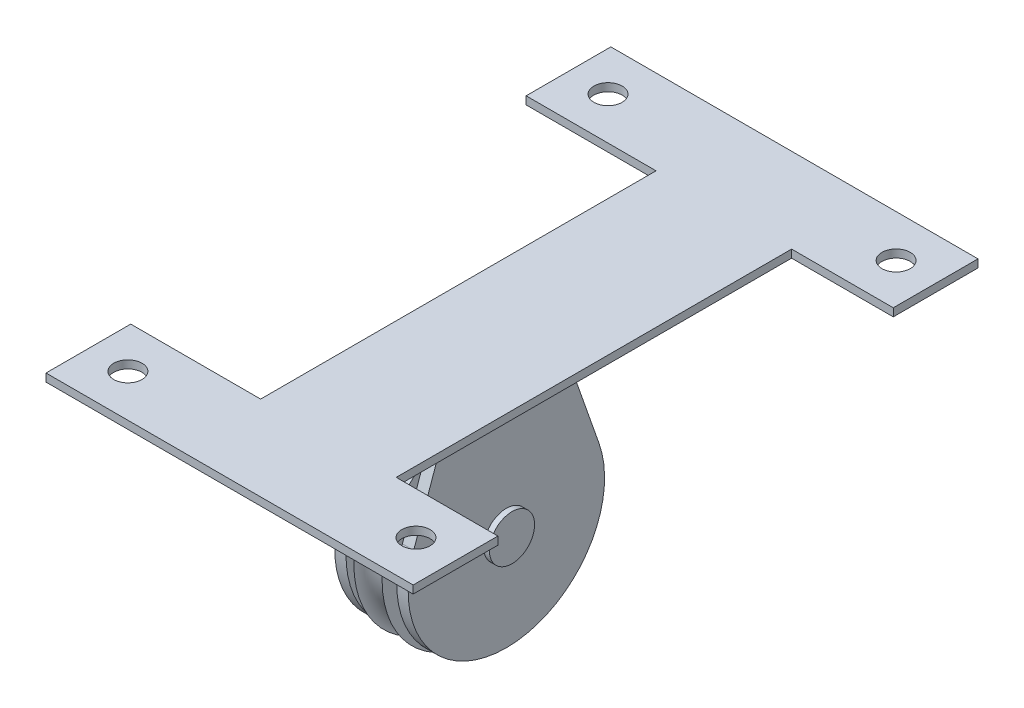
ISO-10303-21;
HEADER;
FILE_DESCRIPTION(('STEP AP214'),'2;1');
FILE_NAME('part.step','',(''),(''),'','','');
FILE_SCHEMA(('AUTOMOTIVE_DESIGN { 1 0 10303 214 1 1 1 1 }'));
ENDSEC;
DATA;
#1=APPLICATION_CONTEXT('core data for automotive mechanical design processes');
#2=APPLICATION_PROTOCOL_DEFINITION('international standard','automotive_design',2000,#1);
#3=PRODUCT_CONTEXT('',#1,'mechanical');
#4=PRODUCT('Part','Part','',(#3));
#5=PRODUCT_RELATED_PRODUCT_CATEGORY('part','',(#4));
#6=PRODUCT_DEFINITION_FORMATION('','',#4);
#7=PRODUCT_DEFINITION_CONTEXT('part definition',#1,'design');
#8=PRODUCT_DEFINITION('design','',#6,#7);
#9=PRODUCT_DEFINITION_SHAPE('','',#8);
#10=(LENGTH_UNIT() NAMED_UNIT(*) SI_UNIT(.MILLI.,.METRE.));
#11=(NAMED_UNIT(*) PLANE_ANGLE_UNIT() SI_UNIT($,.RADIAN.));
#12=(NAMED_UNIT(*) SI_UNIT($,.STERADIAN.) SOLID_ANGLE_UNIT());
#13=UNCERTAINTY_MEASURE_WITH_UNIT(LENGTH_MEASURE(1.E-05),#10,'distance_accuracy_value','');
#14=(GEOMETRIC_REPRESENTATION_CONTEXT(3) GLOBAL_UNCERTAINTY_ASSIGNED_CONTEXT((#13)) GLOBAL_UNIT_ASSIGNED_CONTEXT((#10,
#11,#12)) REPRESENTATION_CONTEXT('',''));
#15=CARTESIAN_POINT('',(0.,0.,0.));
#16=DIRECTION('',(0.,0.,1.));
#17=DIRECTION('',(1.,0.,0.));
#18=AXIS2_PLACEMENT_3D('',#15,#16,#17);
#19=CARTESIAN_POINT('',(0.,28.702,0.));
#20=DIRECTION('',(0.,-1.,0.));
#21=DIRECTION('',(0.,0.,-1.));
#22=AXIS2_PLACEMENT_3D('',#19,#20,#21);
#23=PLANE('',#22);
#24=CARTESIAN_POINT('',(-35.56,28.702,41.275));
#25=DIRECTION('',(0.,-1.,0.));
#26=DIRECTION('',(0.,0.,1.));
#27=AXIS2_PLACEMENT_3D('',#24,#25,#26);
#28=CIRCLE('',#27,3.17499999999999);
#29=CARTESIAN_POINT('',(-35.56,28.702,44.45));
#30=VERTEX_POINT('',#29);
#31=EDGE_CURVE('E712',#30,#30,#28,.T.);
#32=ORIENTED_EDGE('',*,*,#31,.F.);
#33=EDGE_LOOP('',(#32));
#34=FACE_BOUND('',#33,.T.);
#35=CARTESIAN_POINT('',(29.21,28.702,-66.675));
#36=DIRECTION('',(0.,-1.,0.));
#37=DIRECTION('',(0.,0.,1.));
#38=AXIS2_PLACEMENT_3D('',#35,#36,#37);
#39=CIRCLE('',#38,3.17499999999999);
#40=CARTESIAN_POINT('',(29.21,28.702,-63.5));
#41=VERTEX_POINT('',#40);
#42=EDGE_CURVE('E705',#41,#41,#39,.T.);
#43=ORIENTED_EDGE('',*,*,#42,.F.);
#44=EDGE_LOOP('',(#43));
#45=FACE_BOUND('',#44,.T.);
#46=CARTESIAN_POINT('',(-35.56,28.702,-66.675));
#47=DIRECTION('',(0.,-1.,0.));
#48=DIRECTION('',(0.,0.,-1.));
#49=AXIS2_PLACEMENT_3D('',#46,#47,#48);
#50=CIRCLE('',#49,3.17499999999998);
#51=CARTESIAN_POINT('',(-35.56,28.702,-69.85));
#52=VERTEX_POINT('',#51);
#53=EDGE_CURVE('E716',#52,#52,#50,.T.);
#54=ORIENTED_EDGE('',*,*,#53,.F.);
#55=EDGE_LOOP('',(#54));
#56=FACE_BOUND('',#55,.T.);
#57=CARTESIAN_POINT('',(29.21,28.702,41.275));
#58=DIRECTION('',(0.,-1.,0.));
#59=DIRECTION('',(0.,0.,-1.));
#60=AXIS2_PLACEMENT_3D('',#57,#58,#59);
#61=CIRCLE('',#60,3.175);
#62=CARTESIAN_POINT('',(29.21,28.702,38.1));
#63=VERTEX_POINT('',#62);
#64=EDGE_CURVE('E697',#63,#63,#61,.T.);
#65=ORIENTED_EDGE('',*,*,#64,.F.);
#66=EDGE_LOOP('',(#65));
#67=FACE_BOUND('',#66,.T.);
#68=DIRECTION('',(0.,0.,-1.));
#69=VECTOR('',#68,1.);
#70=CARTESIAN_POINT('',(38.1,28.702,50.8));
#71=LINE('',#70,#69);
#72=CARTESIAN_POINT('',(38.1,28.702,50.8));
#73=VERTEX_POINT('',#72);
#74=CARTESIAN_POINT('',(38.1,28.702,31.75));
#75=VERTEX_POINT('',#74);
#76=EDGE_CURVE('E230',#73,#75,#71,.T.);
#77=ORIENTED_EDGE('',*,*,#76,.F.);
#78=DIRECTION('',(1.,0.,0.));
#79=VECTOR('',#78,1.);
#80=CARTESIAN_POINT('',(38.1,28.702,50.8));
#81=LINE('',#80,#79);
#82=CARTESIAN_POINT('',(-44.45,28.702,50.8));
#83=VERTEX_POINT('',#82);
#84=EDGE_CURVE('E264',#83,#73,#81,.T.);
#85=ORIENTED_EDGE('',*,*,#84,.F.);
#86=DIRECTION('',(0.,0.,1.));
#87=VECTOR('',#86,1.);
#88=CARTESIAN_POINT('',(-44.45,28.702,50.8));
#89=LINE('',#88,#87);
#90=CARTESIAN_POINT('',(-44.45,28.702,31.75));
#91=VERTEX_POINT('',#90);
#92=EDGE_CURVE('E261',#91,#83,#89,.T.);
#93=ORIENTED_EDGE('',*,*,#92,.F.);
#94=DIRECTION('',(-1.,0.,0.));
#95=VECTOR('',#94,1.);
#96=CARTESIAN_POINT('',(-44.45,28.702,31.75));
#97=LINE('',#96,#95);
#98=CARTESIAN_POINT('',(-15.2399999999999,28.702,31.75));
#99=VERTEX_POINT('',#98);
#100=EDGE_CURVE('E258',#99,#91,#97,.T.);
#101=ORIENTED_EDGE('',*,*,#100,.F.);
#102=DIRECTION('',(0.,0.,1.));
#103=VECTOR('',#102,1.);
#104=CARTESIAN_POINT('',(-15.2399999999999,28.702,-57.15));
#105=LINE('',#104,#103);
#106=CARTESIAN_POINT('',(-15.2399999999999,28.702,-57.15));
#107=VERTEX_POINT('',#106);
#108=EDGE_CURVE('E255',#107,#99,#105,.T.);
#109=ORIENTED_EDGE('',*,*,#108,.F.);
#110=DIRECTION('',(1.,0.,0.));
#111=VECTOR('',#110,1.);
#112=CARTESIAN_POINT('',(-44.45,28.702,-57.15));
#113=LINE('',#112,#111);
#114=CARTESIAN_POINT('',(-44.45,28.702,-57.15));
#115=VERTEX_POINT('',#114);
#116=EDGE_CURVE('E252',#115,#107,#113,.T.);
#117=ORIENTED_EDGE('',*,*,#116,.F.);
#118=DIRECTION('',(0.,0.,1.));
#119=VECTOR('',#118,1.);
#120=CARTESIAN_POINT('',(-44.45,28.702,-76.2));
#121=LINE('',#120,#119);
#122=CARTESIAN_POINT('',(-44.45,28.702,-76.2));
#123=VERTEX_POINT('',#122);
#124=EDGE_CURVE('E249',#123,#115,#121,.T.);
#125=ORIENTED_EDGE('',*,*,#124,.F.);
#126=DIRECTION('',(-1.,0.,0.));
#127=VECTOR('',#126,1.);
#128=CARTESIAN_POINT('',(38.1,28.702,-76.2));
#129=LINE('',#128,#127);
#130=CARTESIAN_POINT('',(38.1,28.702,-76.2));
#131=VERTEX_POINT('',#130);
#132=EDGE_CURVE('E246',#131,#123,#129,.T.);
#133=ORIENTED_EDGE('',*,*,#132,.F.);
#134=DIRECTION('',(0.,0.,-1.));
#135=VECTOR('',#134,1.);
#136=CARTESIAN_POINT('',(38.1,28.702,-76.2));
#137=LINE('',#136,#135);
#138=CARTESIAN_POINT('',(38.1,28.702,-57.15));
#139=VERTEX_POINT('',#138);
#140=EDGE_CURVE('E243',#139,#131,#137,.T.);
#141=ORIENTED_EDGE('',*,*,#140,.F.);
#142=DIRECTION('',(1.,0.,0.));
#143=VECTOR('',#142,1.);
#144=CARTESIAN_POINT('',(15.24,28.702,-57.15));
#145=LINE('',#144,#143);
#146=CARTESIAN_POINT('',(15.24,28.702,-57.15));
#147=VERTEX_POINT('',#146);
#148=EDGE_CURVE('E240',#147,#139,#145,.T.);
#149=ORIENTED_EDGE('',*,*,#148,.F.);
#150=DIRECTION('',(0.,0.,-1.));
#151=VECTOR('',#150,1.);
#152=CARTESIAN_POINT('',(15.24,28.702,-57.15));
#153=LINE('',#152,#151);
#154=CARTESIAN_POINT('',(15.24,28.702,31.75));
#155=VERTEX_POINT('',#154);
#156=EDGE_CURVE('E237',#155,#147,#153,.T.);
#157=ORIENTED_EDGE('',*,*,#156,.F.);
#158=DIRECTION('',(-1.,0.,0.));
#159=VECTOR('',#158,1.);
#160=CARTESIAN_POINT('',(15.24,28.702,31.75));
#161=LINE('',#160,#159);
#162=EDGE_CURVE('E233',#75,#155,#161,.T.);
#163=ORIENTED_EDGE('',*,*,#162,.F.);
#164=EDGE_LOOP('',(#77,#85,#93,#101,#109,#117,#125,#133,#141,#149,#157,#163));
#165=FACE_BOUND('',#164,.T.);
#166=DIRECTION('',(1.,0.,0.));
#167=VECTOR('',#166,1.);
#168=CARTESIAN_POINT('',(8.255,28.702,-13.3246545720556));
#169=LINE('',#168,#167);
#170=CARTESIAN_POINT('',(5.715,28.702,-13.3246545720556));
#171=VERTEX_POINT('',#170);
#172=CARTESIAN_POINT('',(8.255,28.702,-13.3246545720556));
#173=VERTEX_POINT('',#172);
#174=EDGE_CURVE('E328',#171,#173,#169,.T.);
#175=ORIENTED_EDGE('',*,*,#174,.F.);
#176=DIRECTION('',(0.,0.,-1.));
#177=VECTOR('',#176,1.);
#178=CARTESIAN_POINT('',(5.715,28.702,0.));
#179=LINE('',#178,#177);
#180=CARTESIAN_POINT('',(5.715,28.702,13.3246545720556));
#181=VERTEX_POINT('',#180);
#182=EDGE_CURVE('E70',#181,#171,#179,.T.);
#183=ORIENTED_EDGE('',*,*,#182,.F.);
#184=DIRECTION('',(-1.,0.,0.));
#185=VECTOR('',#184,1.);
#186=CARTESIAN_POINT('',(8.255,28.702,13.3246545720556));
#187=LINE('',#186,#185);
#188=CARTESIAN_POINT('',(8.255,28.702,13.3246545720556));
#189=VERTEX_POINT('',#188);
#190=EDGE_CURVE('E12',#189,#181,#187,.T.);
#191=ORIENTED_EDGE('',*,*,#190,.F.);
#192=DIRECTION('',(0.,0.,-1.));
#193=VECTOR('',#192,1.);
#194=CARTESIAN_POINT('',(8.255,28.702,0.));
#195=LINE('',#194,#193);
#196=EDGE_CURVE('E326',#189,#173,#195,.T.);
#197=ORIENTED_EDGE('',*,*,#196,.T.);
#198=EDGE_LOOP('',(#175,#183,#191,#197));
#199=FACE_BOUND('',#198,.T.);
#200=DIRECTION('',(0.,0.,-1.));
#201=VECTOR('',#200,1.);
#202=CARTESIAN_POINT('',(-5.715,28.702,0.));
#203=LINE('',#202,#201);
#204=CARTESIAN_POINT('',(-5.715,28.702,13.3246545720556));
#205=VERTEX_POINT('',#204);
#206=CARTESIAN_POINT('',(-5.715,28.702,-13.3246545720556));
#207=VERTEX_POINT('',#206);
#208=EDGE_CURVE('E225',#205,#207,#203,.T.);
#209=ORIENTED_EDGE('',*,*,#208,.T.);
#210=DIRECTION('',(-1.,0.,0.));
#211=VECTOR('',#210,1.);
#212=CARTESIAN_POINT('',(0.,28.702,-13.3246545720556));
#213=LINE('',#212,#211);
#214=CARTESIAN_POINT('',(-8.255,28.702,-13.3246545720556));
#215=VERTEX_POINT('',#214);
#216=EDGE_CURVE('E223',#207,#215,#213,.T.);
#217=ORIENTED_EDGE('',*,*,#216,.T.);
#218=DIRECTION('',(0.,0.,-1.));
#219=VECTOR('',#218,1.);
#220=CARTESIAN_POINT('',(-8.255,28.702,0.));
#221=LINE('',#220,#219);
#222=CARTESIAN_POINT('',(-8.255,28.702,13.3246545720556));
#223=VERTEX_POINT('',#222);
#224=EDGE_CURVE('E204',#223,#215,#221,.T.);
#225=ORIENTED_EDGE('',*,*,#224,.F.);
#226=DIRECTION('',(1.,0.,0.));
#227=VECTOR('',#226,1.);
#228=CARTESIAN_POINT('',(0.,28.702,13.3246545720556));
#229=LINE('',#228,#227);
#230=EDGE_CURVE('E194',#223,#205,#229,.T.);
#231=ORIENTED_EDGE('',*,*,#230,.T.);
#232=EDGE_LOOP('',(#209,#217,#225,#231));
#233=FACE_BOUND('',#232,.T.);
#234=ADVANCED_FACE('F47',(#34,#45,#56,#67,#165,#199,#233),#23,.T.);
#235=CARTESIAN_POINT('',(8.255,0.,0.));
#236=DIRECTION('',(1.,0.,0.));
#237=DIRECTION('',(0.,0.,-1.));
#238=AXIS2_PLACEMENT_3D('',#235,#236,#237);
#239=PLANE('',#238);
#240=ORIENTED_EDGE('',*,*,#196,.F.);
#241=DIRECTION('',(0.,-0.943468126786136,0.331463261521786));
#242=VECTOR('',#241,1.);
#243=CARTESIAN_POINT('',(8.255,7.32038118622341,20.8365364336848));
#244=LINE('',#243,#242);
#245=CARTESIAN_POINT('',(8.255,7.32038118622341,20.8365364336848));
#246=VERTEX_POINT('',#245);
#247=EDGE_CURVE('E345',#189,#246,#244,.T.);
#248=ORIENTED_EDGE('',*,*,#247,.T.);
#249=CARTESIAN_POINT('',(8.255,0.,0.));
#250=DIRECTION('',(1.,0.,0.));
#251=DIRECTION('',(0.,0.,-1.));
#252=AXIS2_PLACEMENT_3D('',#249,#250,#251);
#253=CIRCLE('',#252,22.085045421368);
#254=CARTESIAN_POINT('',(8.255,7.32038118622341,-20.8365364336848));
#255=VERTEX_POINT('',#254);
#256=EDGE_CURVE('E338',#246,#255,#253,.T.);
#257=ORIENTED_EDGE('',*,*,#256,.T.);
#258=DIRECTION('',(0.,0.943468126786136,0.331463261521786));
#259=VECTOR('',#258,1.);
#260=CARTESIAN_POINT('',(8.255,7.32038118622341,-20.8365364336848));
#261=LINE('',#260,#259);
#262=EDGE_CURVE('E341',#255,#173,#261,.T.);
#263=ORIENTED_EDGE('',*,*,#262,.T.);
#264=EDGE_LOOP('',(#240,#248,#257,#263));
#265=FACE_BOUND('',#264,.T.);
#266=CARTESIAN_POINT('',(8.255,0.,0.));
#267=DIRECTION('',(1.,0.,0.));
#268=DIRECTION('',(0.,0.,-1.));
#269=AXIS2_PLACEMENT_3D('',#266,#267,#268);
#270=CIRCLE('',#269,5.08);
#271=CARTESIAN_POINT('',(8.255,0.,-5.08));
#272=VERTEX_POINT('',#271);
#273=EDGE_CURVE('E332',#272,#272,#270,.T.);
#274=ORIENTED_EDGE('',*,*,#273,.F.);
#275=EDGE_LOOP('',(#274));
#276=FACE_BOUND('',#275,.T.);
#277=ADVANCED_FACE('F373',(#265,#276),#239,.T.);
#278=CARTESIAN_POINT('',(5.715,0.,0.));
#279=DIRECTION('',(1.,0.,0.));
#280=DIRECTION('',(0.,0.,-1.));
#281=AXIS2_PLACEMENT_3D('',#278,#279,#280);
#282=PLANE('',#281);
#283=DIRECTION('',(0.,-0.943468126786136,0.331463261521786));
#284=VECTOR('',#283,1.);
#285=CARTESIAN_POINT('',(5.715,7.32038118622341,20.8365364336848));
#286=LINE('',#285,#284);
#287=CARTESIAN_POINT('',(5.715,7.32038118622341,20.8365364336848));
#288=VERTEX_POINT('',#287);
#289=EDGE_CURVE('E342',#181,#288,#286,.T.);
#290=ORIENTED_EDGE('',*,*,#289,.F.);
#291=ORIENTED_EDGE('',*,*,#182,.T.);
#292=DIRECTION('',(0.,0.943468126786136,0.331463261521786));
#293=VECTOR('',#292,1.);
#294=CARTESIAN_POINT('',(5.715,7.32038118622341,-20.8365364336848));
#295=LINE('',#294,#293);
#296=CARTESIAN_POINT('',(5.715,7.32038118622341,-20.8365364336848));
#297=VERTEX_POINT('',#296);
#298=EDGE_CURVE('E350',#297,#171,#295,.T.);
#299=ORIENTED_EDGE('',*,*,#298,.F.);
#300=CARTESIAN_POINT('',(5.715,0.,0.));
#301=DIRECTION('',(1.,0.,0.));
#302=DIRECTION('',(0.,0.,-1.));
#303=AXIS2_PLACEMENT_3D('',#300,#301,#302);
#304=CIRCLE('',#303,22.085045421368);
#305=EDGE_CURVE('E335',#288,#297,#304,.T.);
#306=ORIENTED_EDGE('',*,*,#305,.F.);
#307=EDGE_LOOP('',(#290,#291,#299,#306));
#308=FACE_BOUND('',#307,.T.);
#309=CARTESIAN_POINT('',(5.715,0.,0.));
#310=DIRECTION('',(1.,0.,0.));
#311=DIRECTION('',(0.,0.,-1.));
#312=AXIS2_PLACEMENT_3D('',#309,#310,#311);
#313=CIRCLE('',#312,5.08);
#314=CARTESIAN_POINT('',(5.715,0.,-5.08));
#315=VERTEX_POINT('',#314);
#316=EDGE_CURVE('E331',#315,#315,#313,.T.);
#317=ORIENTED_EDGE('',*,*,#316,.T.);
#318=EDGE_LOOP('',(#317));
#319=FACE_BOUND('',#318,.T.);
#320=ADVANCED_FACE('F365',(#308,#319),#282,.F.);
#321=CARTESIAN_POINT('',(8.255,0.,0.));
#322=DIRECTION('',(-1.,0.,0.));
#323=DIRECTION('',(0.,0.,1.));
#324=AXIS2_PLACEMENT_3D('',#321,#322,#323);
#325=CYLINDRICAL_SURFACE('',#324,22.085045421368);
#326=ORIENTED_EDGE('',*,*,#305,.T.);
#327=DIRECTION('',(-1.,0.,0.));
#328=VECTOR('',#327,1.);
#329=CARTESIAN_POINT('',(8.255,7.32038118622341,-20.8365364336848));
#330=LINE('',#329,#328);
#331=EDGE_CURVE('E55',#255,#297,#330,.T.);
#332=ORIENTED_EDGE('',*,*,#331,.F.);
#333=ORIENTED_EDGE('',*,*,#256,.F.);
#334=DIRECTION('',(-1.,0.,0.));
#335=VECTOR('',#334,1.);
#336=CARTESIAN_POINT('',(8.255,7.32038118622341,20.8365364336848));
#337=LINE('',#336,#335);
#338=EDGE_CURVE('E347',#246,#288,#337,.T.);
#339=ORIENTED_EDGE('',*,*,#338,.T.);
#340=EDGE_LOOP('',(#326,#332,#333,#339));
#341=FACE_BOUND('',#340,.T.);
#342=ADVANCED_FACE('F49',(#341),#325,.T.);
#343=CARTESIAN_POINT('',(8.255,7.32038118622341,-20.8365364336848));
#344=DIRECTION('',(0.,-0.331463261521786,0.943468126786136));
#345=DIRECTION('',(0.,-0.943468126786136,-0.331463261521786));
#346=AXIS2_PLACEMENT_3D('',#343,#344,#345);
#347=PLANE('',#346);
#348=ORIENTED_EDGE('',*,*,#298,.T.);
#349=ORIENTED_EDGE('',*,*,#174,.T.);
#350=ORIENTED_EDGE('',*,*,#262,.F.);
#351=ORIENTED_EDGE('',*,*,#331,.T.);
#352=EDGE_LOOP('',(#348,#349,#350,#351));
#353=FACE_BOUND('',#352,.T.);
#354=ADVANCED_FACE('F358',(#353),#347,.F.);
#355=CARTESIAN_POINT('',(8.255,7.32038118622341,20.8365364336848));
#356=DIRECTION('',(0.,-0.331463261521786,-0.943468126786136));
#357=DIRECTION('',(0.,0.943468126786136,-0.331463261521786));
#358=AXIS2_PLACEMENT_3D('',#355,#356,#357);
#359=PLANE('',#358);
#360=ORIENTED_EDGE('',*,*,#247,.F.);
#361=ORIENTED_EDGE('',*,*,#190,.T.);
#362=ORIENTED_EDGE('',*,*,#289,.T.);
#363=ORIENTED_EDGE('',*,*,#338,.F.);
#364=EDGE_LOOP('',(#360,#361,#362,#363));
#365=FACE_BOUND('',#364,.T.);
#366=ADVANCED_FACE('F369',(#365),#359,.F.);
#367=CARTESIAN_POINT('',(8.255,0.,0.));
#368=DIRECTION('',(-1.,0.,0.));
#369=DIRECTION('',(0.,0.,1.));
#370=AXIS2_PLACEMENT_3D('',#367,#368,#369);
#371=CYLINDRICAL_SURFACE('',#370,5.08);
#372=ORIENTED_EDGE('',*,*,#273,.T.);
#373=EDGE_LOOP('',(#372));
#374=FACE_BOUND('',#373,.T.);
#375=ORIENTED_EDGE('',*,*,#316,.F.);
#376=EDGE_LOOP('',(#375));
#377=FACE_BOUND('',#376,.T.);
#378=ADVANCED_FACE('F379',(#374,#377),#371,.F.);
#379=CARTESIAN_POINT('',(38.1,28.702,50.8));
#380=DIRECTION('',(1.,0.,0.));
#381=DIRECTION('',(0.,0.,-1.));
#382=AXIS2_PLACEMENT_3D('',#379,#380,#381);
#383=PLANE('',#382);
#384=DIRECTION('',(0.,0.,-1.));
#385=VECTOR('',#384,1.);
#386=CARTESIAN_POINT('',(38.1,30.48,50.8));
#387=LINE('',#386,#385);
#388=CARTESIAN_POINT('',(38.1,30.48,50.8));
#389=VERTEX_POINT('',#388);
#390=CARTESIAN_POINT('',(38.1,30.48,31.75));
#391=VERTEX_POINT('',#390);
#392=EDGE_CURVE('E229',#389,#391,#387,.T.);
#393=ORIENTED_EDGE('',*,*,#392,.F.);
#394=DIRECTION('',(0.,1.,0.));
#395=VECTOR('',#394,1.);
#396=CARTESIAN_POINT('',(38.1,28.702,50.8));
#397=LINE('',#396,#395);
#398=EDGE_CURVE('E302',#73,#389,#397,.T.);
#399=ORIENTED_EDGE('',*,*,#398,.F.);
#400=ORIENTED_EDGE('',*,*,#76,.T.);
#401=DIRECTION('',(0.,1.,0.));
#402=VECTOR('',#401,1.);
#403=CARTESIAN_POINT('',(38.1,28.702,31.75));
#404=LINE('',#403,#402);
#405=EDGE_CURVE('E267',#75,#391,#404,.T.);
#406=ORIENTED_EDGE('',*,*,#405,.T.);
#407=EDGE_LOOP('',(#393,#399,#400,#406));
#408=FACE_BOUND('',#407,.T.);
#409=ADVANCED_FACE('F382',(#408),#383,.T.);
#410=CARTESIAN_POINT('',(38.1,28.702,50.8));
#411=DIRECTION('',(0.,0.,1.));
#412=DIRECTION('',(1.,0.,0.));
#413=AXIS2_PLACEMENT_3D('',#410,#411,#412);
#414=PLANE('',#413);
#415=DIRECTION('',(1.,0.,0.));
#416=VECTOR('',#415,1.);
#417=CARTESIAN_POINT('',(38.1,30.48,50.8));
#418=LINE('',#417,#416);
#419=CARTESIAN_POINT('',(-44.45,30.48,50.8));
#420=VERTEX_POINT('',#419);
#421=EDGE_CURVE('E234',#420,#389,#418,.T.);
#422=ORIENTED_EDGE('',*,*,#421,.F.);
#423=DIRECTION('',(0.,1.,0.));
#424=VECTOR('',#423,1.);
#425=CARTESIAN_POINT('',(-44.45,28.702,50.8));
#426=LINE('',#425,#424);
#427=EDGE_CURVE('E304',#83,#420,#426,.T.);
#428=ORIENTED_EDGE('',*,*,#427,.F.);
#429=ORIENTED_EDGE('',*,*,#84,.T.);
#430=ORIENTED_EDGE('',*,*,#398,.T.);
#431=EDGE_LOOP('',(#422,#428,#429,#430));
#432=FACE_BOUND('',#431,.T.);
#433=ADVANCED_FACE('F401',(#432),#414,.T.);
#434=CARTESIAN_POINT('',(-44.45,28.702,50.8));
#435=DIRECTION('',(-1.,0.,0.));
#436=DIRECTION('',(0.,0.,1.));
#437=AXIS2_PLACEMENT_3D('',#434,#435,#436);
#438=PLANE('',#437);
#439=DIRECTION('',(0.,0.,1.));
#440=VECTOR('',#439,1.);
#441=CARTESIAN_POINT('',(-44.45,30.48,50.8));
#442=LINE('',#441,#440);
#443=CARTESIAN_POINT('',(-44.45,30.48,31.75));
#444=VERTEX_POINT('',#443);
#445=EDGE_CURVE('E297',#444,#420,#442,.T.);
#446=ORIENTED_EDGE('',*,*,#445,.F.);
#447=DIRECTION('',(0.,1.,0.));
#448=VECTOR('',#447,1.);
#449=CARTESIAN_POINT('',(-44.45,28.702,31.75));
#450=LINE('',#449,#448);
#451=EDGE_CURVE('E306',#91,#444,#450,.T.);
#452=ORIENTED_EDGE('',*,*,#451,.F.);
#453=ORIENTED_EDGE('',*,*,#92,.T.);
#454=ORIENTED_EDGE('',*,*,#427,.T.);
#455=EDGE_LOOP('',(#446,#452,#453,#454));
#456=FACE_BOUND('',#455,.T.);
#457=ADVANCED_FACE('F404',(#456),#438,.T.);
#458=CARTESIAN_POINT('',(-44.45,28.702,31.75));
#459=DIRECTION('',(0.,0.,-1.));
#460=DIRECTION('',(-1.,0.,0.));
#461=AXIS2_PLACEMENT_3D('',#458,#459,#460);
#462=PLANE('',#461);
#463=DIRECTION('',(-1.,0.,0.));
#464=VECTOR('',#463,1.);
#465=CARTESIAN_POINT('',(-44.45,30.48,31.75));
#466=LINE('',#465,#464);
#467=CARTESIAN_POINT('',(-15.2399999999999,30.48,31.75));
#468=VERTEX_POINT('',#467);
#469=EDGE_CURVE('E294',#468,#444,#466,.T.);
#470=ORIENTED_EDGE('',*,*,#469,.F.);
#471=DIRECTION('',(0.,1.,0.));
#472=VECTOR('',#471,1.);
#473=CARTESIAN_POINT('',(-15.2399999999999,28.702,31.75));
#474=LINE('',#473,#472);
#475=EDGE_CURVE('E308',#99,#468,#474,.T.);
#476=ORIENTED_EDGE('',*,*,#475,.F.);
#477=ORIENTED_EDGE('',*,*,#100,.T.);
#478=ORIENTED_EDGE('',*,*,#451,.T.);
#479=EDGE_LOOP('',(#470,#476,#477,#478));
#480=FACE_BOUND('',#479,.T.);
#481=ADVANCED_FACE('F408',(#480),#462,.T.);
#482=CARTESIAN_POINT('',(-15.2399999999999,28.702,-57.15));
#483=DIRECTION('',(-1.,0.,0.));
#484=DIRECTION('',(0.,0.,1.));
#485=AXIS2_PLACEMENT_3D('',#482,#483,#484);
#486=PLANE('',#485);
#487=DIRECTION('',(0.,0.,1.));
#488=VECTOR('',#487,1.);
#489=CARTESIAN_POINT('',(-15.2399999999999,30.48,-57.15));
#490=LINE('',#489,#488);
#491=CARTESIAN_POINT('',(-15.2399999999999,30.48,-57.15));
#492=VERTEX_POINT('',#491);
#493=EDGE_CURVE('E291',#492,#468,#490,.T.);
#494=ORIENTED_EDGE('',*,*,#493,.F.);
#495=DIRECTION('',(0.,1.,0.));
#496=VECTOR('',#495,1.);
#497=CARTESIAN_POINT('',(-15.2399999999999,28.702,-57.15));
#498=LINE('',#497,#496);
#499=EDGE_CURVE('E310',#107,#492,#498,.T.);
#500=ORIENTED_EDGE('',*,*,#499,.F.);
#501=ORIENTED_EDGE('',*,*,#108,.T.);
#502=ORIENTED_EDGE('',*,*,#475,.T.);
#503=EDGE_LOOP('',(#494,#500,#501,#502));
#504=FACE_BOUND('',#503,.T.);
#505=ADVANCED_FACE('F412',(#504),#486,.T.);
#506=CARTESIAN_POINT('',(-44.45,28.702,-57.15));
#507=DIRECTION('',(0.,0.,1.));
#508=DIRECTION('',(1.,0.,0.));
#509=AXIS2_PLACEMENT_3D('',#506,#507,#508);
#510=PLANE('',#509);
#511=DIRECTION('',(1.,0.,0.));
#512=VECTOR('',#511,1.);
#513=CARTESIAN_POINT('',(-44.45,30.48,-57.15));
#514=LINE('',#513,#512);
#515=CARTESIAN_POINT('',(-44.45,30.48,-57.15));
#516=VERTEX_POINT('',#515);
#517=EDGE_CURVE('E288',#516,#492,#514,.T.);
#518=ORIENTED_EDGE('',*,*,#517,.F.);
#519=DIRECTION('',(0.,1.,0.));
#520=VECTOR('',#519,1.);
#521=CARTESIAN_POINT('',(-44.45,28.702,-57.15));
#522=LINE('',#521,#520);
#523=EDGE_CURVE('E312',#115,#516,#522,.T.);
#524=ORIENTED_EDGE('',*,*,#523,.F.);
#525=ORIENTED_EDGE('',*,*,#116,.T.);
#526=ORIENTED_EDGE('',*,*,#499,.T.);
#527=EDGE_LOOP('',(#518,#524,#525,#526));
#528=FACE_BOUND('',#527,.T.);
#529=ADVANCED_FACE('F416',(#528),#510,.T.);
#530=CARTESIAN_POINT('',(-44.45,28.702,-76.2));
#531=DIRECTION('',(-1.,0.,0.));
#532=DIRECTION('',(0.,0.,1.));
#533=AXIS2_PLACEMENT_3D('',#530,#531,#532);
#534=PLANE('',#533);
#535=DIRECTION('',(0.,0.,1.));
#536=VECTOR('',#535,1.);
#537=CARTESIAN_POINT('',(-44.45,30.48,-76.2));
#538=LINE('',#537,#536);
#539=CARTESIAN_POINT('',(-44.45,30.48,-76.2));
#540=VERTEX_POINT('',#539);
#541=EDGE_CURVE('E285',#540,#516,#538,.T.);
#542=ORIENTED_EDGE('',*,*,#541,.F.);
#543=DIRECTION('',(0.,1.,0.));
#544=VECTOR('',#543,1.);
#545=CARTESIAN_POINT('',(-44.45,28.702,-76.2));
#546=LINE('',#545,#544);
#547=EDGE_CURVE('E314',#123,#540,#546,.T.);
#548=ORIENTED_EDGE('',*,*,#547,.F.);
#549=ORIENTED_EDGE('',*,*,#124,.T.);
#550=ORIENTED_EDGE('',*,*,#523,.T.);
#551=EDGE_LOOP('',(#542,#548,#549,#550));
#552=FACE_BOUND('',#551,.T.);
#553=ADVANCED_FACE('F420',(#552),#534,.T.);
#554=CARTESIAN_POINT('',(38.1,28.702,-76.2));
#555=DIRECTION('',(0.,0.,-1.));
#556=DIRECTION('',(-1.,0.,0.));
#557=AXIS2_PLACEMENT_3D('',#554,#555,#556);
#558=PLANE('',#557);
#559=DIRECTION('',(-1.,0.,0.));
#560=VECTOR('',#559,1.);
#561=CARTESIAN_POINT('',(38.1,30.48,-76.2));
#562=LINE('',#561,#560);
#563=CARTESIAN_POINT('',(38.1,30.48,-76.2));
#564=VERTEX_POINT('',#563);
#565=EDGE_CURVE('E282',#564,#540,#562,.T.);
#566=ORIENTED_EDGE('',*,*,#565,.F.);
#567=DIRECTION('',(0.,1.,0.));
#568=VECTOR('',#567,1.);
#569=CARTESIAN_POINT('',(38.1,28.702,-76.2));
#570=LINE('',#569,#568);
#571=EDGE_CURVE('E316',#131,#564,#570,.T.);
#572=ORIENTED_EDGE('',*,*,#571,.F.);
#573=ORIENTED_EDGE('',*,*,#132,.T.);
#574=ORIENTED_EDGE('',*,*,#547,.T.);
#575=EDGE_LOOP('',(#566,#572,#573,#574));
#576=FACE_BOUND('',#575,.T.);
#577=ADVANCED_FACE('F424',(#576),#558,.T.);
#578=CARTESIAN_POINT('',(38.1,28.702,-76.2));
#579=DIRECTION('',(1.,0.,0.));
#580=DIRECTION('',(0.,0.,-1.));
#581=AXIS2_PLACEMENT_3D('',#578,#579,#580);
#582=PLANE('',#581);
#583=DIRECTION('',(0.,0.,-1.));
#584=VECTOR('',#583,1.);
#585=CARTESIAN_POINT('',(38.1,30.48,-76.2));
#586=LINE('',#585,#584);
#587=CARTESIAN_POINT('',(38.1,30.48,-57.15));
#588=VERTEX_POINT('',#587);
#589=EDGE_CURVE('E279',#588,#564,#586,.T.);
#590=ORIENTED_EDGE('',*,*,#589,.F.);
#591=DIRECTION('',(0.,1.,0.));
#592=VECTOR('',#591,1.);
#593=CARTESIAN_POINT('',(38.1,28.702,-57.15));
#594=LINE('',#593,#592);
#595=EDGE_CURVE('E318',#139,#588,#594,.T.);
#596=ORIENTED_EDGE('',*,*,#595,.F.);
#597=ORIENTED_EDGE('',*,*,#140,.T.);
#598=ORIENTED_EDGE('',*,*,#571,.T.);
#599=EDGE_LOOP('',(#590,#596,#597,#598));
#600=FACE_BOUND('',#599,.T.);
#601=ADVANCED_FACE('F428',(#600),#582,.T.);
#602=CARTESIAN_POINT('',(15.24,28.702,-57.15));
#603=DIRECTION('',(0.,0.,1.));
#604=DIRECTION('',(1.,0.,0.));
#605=AXIS2_PLACEMENT_3D('',#602,#603,#604);
#606=PLANE('',#605);
#607=DIRECTION('',(1.,0.,0.));
#608=VECTOR('',#607,1.);
#609=CARTESIAN_POINT('',(15.24,30.48,-57.15));
#610=LINE('',#609,#608);
#611=CARTESIAN_POINT('',(15.24,30.48,-57.15));
#612=VERTEX_POINT('',#611);
#613=EDGE_CURVE('E276',#612,#588,#610,.T.);
#614=ORIENTED_EDGE('',*,*,#613,.F.);
#615=DIRECTION('',(0.,1.,0.));
#616=VECTOR('',#615,1.);
#617=CARTESIAN_POINT('',(15.24,28.702,-57.15));
#618=LINE('',#617,#616);
#619=EDGE_CURVE('E320',#147,#612,#618,.T.);
#620=ORIENTED_EDGE('',*,*,#619,.F.);
#621=ORIENTED_EDGE('',*,*,#148,.T.);
#622=ORIENTED_EDGE('',*,*,#595,.T.);
#623=EDGE_LOOP('',(#614,#620,#621,#622));
#624=FACE_BOUND('',#623,.T.);
#625=ADVANCED_FACE('F432',(#624),#606,.T.);
#626=CARTESIAN_POINT('',(15.24,28.702,-57.15));
#627=DIRECTION('',(1.,0.,0.));
#628=DIRECTION('',(0.,0.,-1.));
#629=AXIS2_PLACEMENT_3D('',#626,#627,#628);
#630=PLANE('',#629);
#631=DIRECTION('',(0.,0.,-1.));
#632=VECTOR('',#631,1.);
#633=CARTESIAN_POINT('',(15.24,30.48,-57.15));
#634=LINE('',#633,#632);
#635=CARTESIAN_POINT('',(15.24,30.48,31.75));
#636=VERTEX_POINT('',#635);
#637=EDGE_CURVE('E273',#636,#612,#634,.T.);
#638=ORIENTED_EDGE('',*,*,#637,.F.);
#639=DIRECTION('',(0.,1.,0.));
#640=VECTOR('',#639,1.);
#641=CARTESIAN_POINT('',(15.24,28.702,31.75));
#642=LINE('',#641,#640);
#643=EDGE_CURVE('E322',#155,#636,#642,.T.);
#644=ORIENTED_EDGE('',*,*,#643,.F.);
#645=ORIENTED_EDGE('',*,*,#156,.T.);
#646=ORIENTED_EDGE('',*,*,#619,.T.);
#647=EDGE_LOOP('',(#638,#644,#645,#646));
#648=FACE_BOUND('',#647,.T.);
#649=ADVANCED_FACE('F436',(#648),#630,.T.);
#650=CARTESIAN_POINT('',(15.24,28.702,31.75));
#651=DIRECTION('',(0.,0.,-1.));
#652=DIRECTION('',(-1.,0.,0.));
#653=AXIS2_PLACEMENT_3D('',#650,#651,#652);
#654=PLANE('',#653);
#655=DIRECTION('',(-1.,0.,0.));
#656=VECTOR('',#655,1.);
#657=CARTESIAN_POINT('',(15.24,30.48,31.75));
#658=LINE('',#657,#656);
#659=EDGE_CURVE('E270',#391,#636,#658,.T.);
#660=ORIENTED_EDGE('',*,*,#659,.F.);
#661=ORIENTED_EDGE('',*,*,#405,.F.);
#662=ORIENTED_EDGE('',*,*,#162,.T.);
#663=ORIENTED_EDGE('',*,*,#643,.T.);
#664=EDGE_LOOP('',(#660,#661,#662,#663));
#665=FACE_BOUND('',#664,.T.);
#666=ADVANCED_FACE('F440',(#665),#654,.T.);
#667=CARTESIAN_POINT('',(8.255,30.48,-12.7));
#668=DIRECTION('',(0.,-1.,0.));
#669=DIRECTION('',(0.,0.,-1.));
#670=AXIS2_PLACEMENT_3D('',#667,#668,#669);
#671=PLANE('',#670);
#672=CARTESIAN_POINT('',(-35.56,30.48,41.275));
#673=DIRECTION('',(0.,-1.,0.));
#674=DIRECTION('',(0.,0.,1.));
#675=AXIS2_PLACEMENT_3D('',#672,#673,#674);
#676=CIRCLE('',#675,3.17499999999999);
#677=CARTESIAN_POINT('',(-35.56,30.48,44.45));
#678=VERTEX_POINT('',#677);
#679=EDGE_CURVE('E702',#678,#678,#676,.T.);
#680=ORIENTED_EDGE('',*,*,#679,.T.);
#681=EDGE_LOOP('',(#680));
#682=FACE_BOUND('',#681,.T.);
#683=CARTESIAN_POINT('',(29.21,30.48,-66.675));
#684=DIRECTION('',(0.,-1.,0.));
#685=DIRECTION('',(0.,0.,1.));
#686=AXIS2_PLACEMENT_3D('',#683,#684,#685);
#687=CIRCLE('',#686,3.17499999999999);
#688=CARTESIAN_POINT('',(29.21,30.48,-63.5));
#689=VERTEX_POINT('',#688);
#690=EDGE_CURVE('E708',#689,#689,#687,.T.);
#691=ORIENTED_EDGE('',*,*,#690,.T.);
#692=EDGE_LOOP('',(#691));
#693=FACE_BOUND('',#692,.T.);
#694=CARTESIAN_POINT('',(-35.56,30.48,-66.675));
#695=DIRECTION('',(0.,-1.,0.));
#696=DIRECTION('',(0.,0.,-1.));
#697=AXIS2_PLACEMENT_3D('',#694,#695,#696);
#698=CIRCLE('',#697,3.17499999999998);
#699=CARTESIAN_POINT('',(-35.56,30.48,-69.85));
#700=VERTEX_POINT('',#699);
#701=EDGE_CURVE('E709',#700,#700,#698,.T.);
#702=ORIENTED_EDGE('',*,*,#701,.T.);
#703=EDGE_LOOP('',(#702));
#704=FACE_BOUND('',#703,.T.);
#705=CARTESIAN_POINT('',(29.21,30.48,41.275));
#706=DIRECTION('',(0.,-1.,0.));
#707=DIRECTION('',(0.,0.,-1.));
#708=AXIS2_PLACEMENT_3D('',#705,#706,#707);
#709=CIRCLE('',#708,3.175);
#710=CARTESIAN_POINT('',(29.21,30.48,38.1));
#711=VERTEX_POINT('',#710);
#712=EDGE_CURVE('E694',#711,#711,#709,.T.);
#713=ORIENTED_EDGE('',*,*,#712,.T.);
#714=EDGE_LOOP('',(#713));
#715=FACE_BOUND('',#714,.T.);
#716=ORIENTED_EDGE('',*,*,#392,.T.);
#717=ORIENTED_EDGE('',*,*,#659,.T.);
#718=ORIENTED_EDGE('',*,*,#637,.T.);
#719=ORIENTED_EDGE('',*,*,#613,.T.);
#720=ORIENTED_EDGE('',*,*,#589,.T.);
#721=ORIENTED_EDGE('',*,*,#565,.T.);
#722=ORIENTED_EDGE('',*,*,#541,.T.);
#723=ORIENTED_EDGE('',*,*,#517,.T.);
#724=ORIENTED_EDGE('',*,*,#493,.T.);
#725=ORIENTED_EDGE('',*,*,#469,.T.);
#726=ORIENTED_EDGE('',*,*,#445,.T.);
#727=ORIENTED_EDGE('',*,*,#421,.T.);
#728=EDGE_LOOP('',(#716,#717,#718,#719,#720,#721,#722,#723,#724,#725,#726,#727));
#729=FACE_BOUND('',#728,.T.);
#730=ADVANCED_FACE('F444',(#682,#693,#704,#715,#729),#671,.F.);
#731=CARTESIAN_POINT('',(-8.255,0.,0.));
#732=DIRECTION('',(-1.,0.,0.));
#733=DIRECTION('',(0.,0.,-1.));
#734=AXIS2_PLACEMENT_3D('',#731,#732,#733);
#735=PLANE('',#734);
#736=DIRECTION('',(0.,-0.943468126786136,0.331463261521786));
#737=VECTOR('',#736,1.);
#738=CARTESIAN_POINT('',(-8.255,7.32038118622341,20.8365364336848));
#739=LINE('',#738,#737);
#740=CARTESIAN_POINT('',(-8.255,7.32038118622341,20.8365364336848));
#741=VERTEX_POINT('',#740);
#742=EDGE_CURVE('E205',#223,#741,#739,.T.);
#743=ORIENTED_EDGE('',*,*,#742,.F.);
#744=ORIENTED_EDGE('',*,*,#224,.T.);
#745=DIRECTION('',(0.,0.943468126786136,0.331463261521786));
#746=VECTOR('',#745,1.);
#747=CARTESIAN_POINT('',(-8.255,7.32038118622341,-20.8365364336848));
#748=LINE('',#747,#746);
#749=CARTESIAN_POINT('',(-8.255,7.32038118622341,-20.8365364336848));
#750=VERTEX_POINT('',#749);
#751=EDGE_CURVE('E186',#750,#215,#748,.T.);
#752=ORIENTED_EDGE('',*,*,#751,.F.);
#753=CARTESIAN_POINT('',(-8.255,0.,0.));
#754=DIRECTION('',(1.,0.,0.));
#755=DIRECTION('',(0.,0.,-1.));
#756=AXIS2_PLACEMENT_3D('',#753,#754,#755);
#757=CIRCLE('',#756,22.085045421368);
#758=EDGE_CURVE('E202',#741,#750,#757,.T.);
#759=ORIENTED_EDGE('',*,*,#758,.F.);
#760=EDGE_LOOP('',(#743,#744,#752,#759));
#761=FACE_BOUND('',#760,.T.);
#762=CARTESIAN_POINT('',(-8.255,0.,0.));
#763=DIRECTION('',(1.,0.,0.));
#764=DIRECTION('',(0.,0.,-1.));
#765=AXIS2_PLACEMENT_3D('',#762,#763,#764);
#766=CIRCLE('',#765,5.08);
#767=CARTESIAN_POINT('',(-8.255,0.,-5.08));
#768=VERTEX_POINT('',#767);
#769=EDGE_CURVE('E218',#768,#768,#766,.T.);
#770=ORIENTED_EDGE('',*,*,#769,.T.);
#771=EDGE_LOOP('',(#770));
#772=FACE_BOUND('',#771,.T.);
#773=ADVANCED_FACE('F200',(#761,#772),#735,.T.);
#774=CARTESIAN_POINT('',(-5.715,0.,0.));
#775=DIRECTION('',(-1.,0.,0.));
#776=DIRECTION('',(0.,0.,-1.));
#777=AXIS2_PLACEMENT_3D('',#774,#775,#776);
#778=PLANE('',#777);
#779=ORIENTED_EDGE('',*,*,#208,.F.);
#780=DIRECTION('',(0.,-0.943468126786136,0.331463261521786));
#781=VECTOR('',#780,1.);
#782=CARTESIAN_POINT('',(-5.715,7.32038118622341,20.8365364336848));
#783=LINE('',#782,#781);
#784=CARTESIAN_POINT('',(-5.715,7.32038118622341,20.8365364336848));
#785=VERTEX_POINT('',#784);
#786=EDGE_CURVE('E62',#205,#785,#783,.T.);
#787=ORIENTED_EDGE('',*,*,#786,.T.);
#788=CARTESIAN_POINT('',(-5.715,0.,0.));
#789=DIRECTION('',(1.,0.,0.));
#790=DIRECTION('',(0.,0.,-1.));
#791=AXIS2_PLACEMENT_3D('',#788,#789,#790);
#792=CIRCLE('',#791,22.085045421368);
#793=CARTESIAN_POINT('',(-5.715,7.32038118622341,-20.8365364336848));
#794=VERTEX_POINT('',#793);
#795=EDGE_CURVE('E216',#785,#794,#792,.T.);
#796=ORIENTED_EDGE('',*,*,#795,.T.);
#797=DIRECTION('',(0.,0.943468126786136,0.331463261521786));
#798=VECTOR('',#797,1.);
#799=CARTESIAN_POINT('',(-5.715,7.32038118622341,-20.8365364336848));
#800=LINE('',#799,#798);
#801=EDGE_CURVE('E189',#794,#207,#800,.T.);
#802=ORIENTED_EDGE('',*,*,#801,.T.);
#803=EDGE_LOOP('',(#779,#787,#796,#802));
#804=FACE_BOUND('',#803,.T.);
#805=CARTESIAN_POINT('',(-5.715,0.,0.));
#806=DIRECTION('',(1.,0.,0.));
#807=DIRECTION('',(0.,0.,-1.));
#808=AXIS2_PLACEMENT_3D('',#805,#806,#807);
#809=CIRCLE('',#808,5.08);
#810=CARTESIAN_POINT('',(-5.715,0.,-5.08));
#811=VERTEX_POINT('',#810);
#812=EDGE_CURVE('E212',#811,#811,#809,.T.);
#813=ORIENTED_EDGE('',*,*,#812,.F.);
#814=EDGE_LOOP('',(#813));
#815=FACE_BOUND('',#814,.T.);
#816=ADVANCED_FACE('F482',(#804,#815),#778,.F.);
#817=CARTESIAN_POINT('',(-8.255,0.,0.));
#818=DIRECTION('',(1.,0.,0.));
#819=DIRECTION('',(0.,0.,1.));
#820=AXIS2_PLACEMENT_3D('',#817,#818,#819);
#821=CYLINDRICAL_SURFACE('',#820,22.085045421368);
#822=ORIENTED_EDGE('',*,*,#795,.F.);
#823=DIRECTION('',(1.,0.,0.));
#824=VECTOR('',#823,1.);
#825=CARTESIAN_POINT('',(-8.255,7.32038118622341,20.8365364336848));
#826=LINE('',#825,#824);
#827=EDGE_CURVE('E195',#741,#785,#826,.T.);
#828=ORIENTED_EDGE('',*,*,#827,.F.);
#829=ORIENTED_EDGE('',*,*,#758,.T.);
#830=DIRECTION('',(1.,0.,0.));
#831=VECTOR('',#830,1.);
#832=CARTESIAN_POINT('',(-8.255,7.32038118622341,-20.8365364336848));
#833=LINE('',#832,#831);
#834=EDGE_CURVE('E183',#750,#794,#833,.T.);
#835=ORIENTED_EDGE('',*,*,#834,.T.);
#836=EDGE_LOOP('',(#822,#828,#829,#835));
#837=FACE_BOUND('',#836,.T.);
#838=ADVANCED_FACE('F208',(#837),#821,.T.);
#839=CARTESIAN_POINT('',(-8.255,7.32038118622341,-20.8365364336848));
#840=DIRECTION('',(0.,-0.331463261521786,0.943468126786136));
#841=DIRECTION('',(0.,-0.943468126786136,-0.331463261521786));
#842=AXIS2_PLACEMENT_3D('',#839,#840,#841);
#843=PLANE('',#842);
#844=ORIENTED_EDGE('',*,*,#216,.F.);
#845=ORIENTED_EDGE('',*,*,#801,.F.);
#846=ORIENTED_EDGE('',*,*,#834,.F.);
#847=ORIENTED_EDGE('',*,*,#751,.T.);
#848=EDGE_LOOP('',(#844,#845,#846,#847));
#849=FACE_BOUND('',#848,.T.);
#850=ADVANCED_FACE('F185',(#849),#843,.F.);
#851=CARTESIAN_POINT('',(-8.255,7.32038118622341,20.8365364336848));
#852=DIRECTION('',(0.,-0.331463261521786,-0.943468126786136));
#853=DIRECTION('',(0.,0.943468126786136,-0.331463261521786));
#854=AXIS2_PLACEMENT_3D('',#851,#852,#853);
#855=PLANE('',#854);
#856=ORIENTED_EDGE('',*,*,#230,.F.);
#857=ORIENTED_EDGE('',*,*,#742,.T.);
#858=ORIENTED_EDGE('',*,*,#827,.T.);
#859=ORIENTED_EDGE('',*,*,#786,.F.);
#860=EDGE_LOOP('',(#856,#857,#858,#859));
#861=FACE_BOUND('',#860,.T.);
#862=ADVANCED_FACE('F579',(#861),#855,.F.);
#863=CARTESIAN_POINT('',(-8.255,0.,0.));
#864=DIRECTION('',(1.,0.,0.));
#865=DIRECTION('',(0.,0.,1.));
#866=AXIS2_PLACEMENT_3D('',#863,#864,#865);
#867=CYLINDRICAL_SURFACE('',#866,5.08);
#868=ORIENTED_EDGE('',*,*,#769,.F.);
#869=EDGE_LOOP('',(#868));
#870=FACE_BOUND('',#869,.T.);
#871=ORIENTED_EDGE('',*,*,#812,.T.);
#872=EDGE_LOOP('',(#871));
#873=FACE_BOUND('',#872,.T.);
#874=ADVANCED_FACE('F542',(#870,#873),#867,.F.);
#875=CARTESIAN_POINT('',(29.21,30.48,41.275));
#876=DIRECTION('',(0.,-1.,0.));
#877=DIRECTION('',(0.,0.,-1.));
#878=AXIS2_PLACEMENT_3D('',#875,#876,#877);
#879=CYLINDRICAL_SURFACE('',#878,3.175);
#880=ORIENTED_EDGE('',*,*,#712,.F.);
#881=EDGE_LOOP('',(#880));
#882=FACE_BOUND('',#881,.T.);
#883=ORIENTED_EDGE('',*,*,#64,.T.);
#884=EDGE_LOOP('',(#883));
#885=FACE_BOUND('',#884,.T.);
#886=ADVANCED_FACE('F536',(#882,#885),#879,.F.);
#887=CARTESIAN_POINT('',(-35.56,30.48,-66.675));
#888=DIRECTION('',(0.,-1.,0.));
#889=DIRECTION('',(0.,0.,-1.));
#890=AXIS2_PLACEMENT_3D('',#887,#888,#889);
#891=CYLINDRICAL_SURFACE('',#890,3.17499999999998);
#892=ORIENTED_EDGE('',*,*,#701,.F.);
#893=EDGE_LOOP('',(#892));
#894=FACE_BOUND('',#893,.T.);
#895=ORIENTED_EDGE('',*,*,#53,.T.);
#896=EDGE_LOOP('',(#895));
#897=FACE_BOUND('',#896,.T.);
#898=ADVANCED_FACE('F541',(#894,#897),#891,.F.);
#899=CARTESIAN_POINT('',(29.21,30.48,-66.675));
#900=DIRECTION('',(0.,-1.,0.));
#901=DIRECTION('',(0.,0.,-1.));
#902=AXIS2_PLACEMENT_3D('',#899,#900,#901);
#903=CYLINDRICAL_SURFACE('',#902,3.17499999999999);
#904=ORIENTED_EDGE('',*,*,#690,.F.);
#905=EDGE_LOOP('',(#904));
#906=FACE_BOUND('',#905,.T.);
#907=ORIENTED_EDGE('',*,*,#42,.T.);
#908=EDGE_LOOP('',(#907));
#909=FACE_BOUND('',#908,.T.);
#910=ADVANCED_FACE('F551',(#906,#909),#903,.F.);
#911=CARTESIAN_POINT('',(-35.56,30.48,41.275));
#912=DIRECTION('',(0.,-1.,0.));
#913=DIRECTION('',(0.,0.,-1.));
#914=AXIS2_PLACEMENT_3D('',#911,#912,#913);
#915=CYLINDRICAL_SURFACE('',#914,3.17499999999999);
#916=ORIENTED_EDGE('',*,*,#679,.F.);
#917=EDGE_LOOP('',(#916));
#918=FACE_BOUND('',#917,.T.);
#919=ORIENTED_EDGE('',*,*,#31,.T.);
#920=EDGE_LOOP('',(#919));
#921=FACE_BOUND('',#920,.T.);
#922=ADVANCED_FACE('F560',(#918,#921),#915,.F.);
#923=CLOSED_SHELL('',(#234,#277,#320,#342,#354,#366,#378,#409,#433,#457,#481,#505,#529,#553,
#577,#601,#625,#649,#666,#730,#773,#816,#838,#850,#862,#874,#886,#898,#910,#922));
#924=MANIFOLD_SOLID_BREP('B2',#923);
#925=CARTESIAN_POINT('',(0.,0.,0.));
#926=DIRECTION('',(-1.,0.,0.));
#927=DIRECTION('',(0.,0.,1.));
#928=AXIS2_PLACEMENT_3D('',#925,#926,#927);
#929=TOROIDAL_SURFACE('',#928,22.86,3.175);
#930=CARTESIAN_POINT('',(-3.175,0.,0.));
#931=DIRECTION('',(-1.,0.,0.));
#932=DIRECTION('',(0.,0.,1.));
#933=AXIS2_PLACEMENT_3D('',#930,#931,#932);
#934=CIRCLE('',#933,22.86);
#935=CARTESIAN_POINT('',(-3.175,0.,22.86));
#936=VERTEX_POINT('',#935);
#937=EDGE_CURVE('E46',#936,#936,#934,.T.);
#938=ORIENTED_EDGE('',*,*,#937,.F.);
#939=EDGE_LOOP('',(#938));
#940=FACE_BOUND('',#939,.T.);
#941=CARTESIAN_POINT('',(3.175,0.,0.));
#942=DIRECTION('',(-1.,0.,0.));
#943=DIRECTION('',(0.,0.,1.));
#944=AXIS2_PLACEMENT_3D('',#941,#942,#943);
#945=CIRCLE('',#944,22.86);
#946=CARTESIAN_POINT('',(3.175,0.,22.86));
#947=VERTEX_POINT('',#946);
#948=EDGE_CURVE('E748',#947,#947,#945,.T.);
#949=ORIENTED_EDGE('',*,*,#948,.T.);
#950=EDGE_LOOP('',(#949));
#951=FACE_BOUND('',#950,.T.);
#952=ADVANCED_FACE('F738',(#940,#951),#929,.F.);
#953=CARTESIAN_POINT('',(-3.175,5.08,0.));
#954=DIRECTION('',(1.,0.,0.));
#955=DIRECTION('',(0.,0.,-1.));
#956=AXIS2_PLACEMENT_3D('',#953,#954,#955);
#957=PLANE('',#956);
#958=CARTESIAN_POINT('',(-3.175,0.,0.));
#959=DIRECTION('',(-1.,0.,0.));
#960=DIRECTION('',(0.,0.,1.));
#961=AXIS2_PLACEMENT_3D('',#958,#959,#960);
#962=CIRCLE('',#961,5.08);
#963=CARTESIAN_POINT('',(-3.175,0.,5.08));
#964=VERTEX_POINT('',#963);
#965=EDGE_CURVE('E744',#964,#964,#962,.T.);
#966=ORIENTED_EDGE('',*,*,#965,.F.);
#967=EDGE_LOOP('',(#966));
#968=FACE_BOUND('',#967,.T.);
#969=ORIENTED_EDGE('',*,*,#937,.T.);
#970=EDGE_LOOP('',(#969));
#971=FACE_BOUND('',#970,.T.);
#972=ADVANCED_FACE('F775',(#968,#971),#957,.F.);
#973=CARTESIAN_POINT('',(3.175,5.08,0.));
#974=DIRECTION('',(-1.,0.,0.));
#975=DIRECTION('',(0.,0.,1.));
#976=AXIS2_PLACEMENT_3D('',#973,#974,#975);
#977=PLANE('',#976);
#978=ORIENTED_EDGE('',*,*,#948,.F.);
#979=EDGE_LOOP('',(#978));
#980=FACE_BOUND('',#979,.T.);
#981=CARTESIAN_POINT('',(3.175,0.,0.));
#982=DIRECTION('',(-1.,0.,0.));
#983=DIRECTION('',(0.,0.,1.));
#984=AXIS2_PLACEMENT_3D('',#981,#982,#983);
#985=CIRCLE('',#984,5.08);
#986=CARTESIAN_POINT('',(3.175,0.,5.08));
#987=VERTEX_POINT('',#986);
#988=EDGE_CURVE('E752',#987,#987,#985,.F.);
#989=ORIENTED_EDGE('',*,*,#988,.F.);
#990=EDGE_LOOP('',(#989));
#991=FACE_BOUND('',#990,.T.);
#992=ADVANCED_FACE('F773',(#980,#991),#977,.F.);
#993=CARTESIAN_POINT('',(9.525,0.,0.));
#994=DIRECTION('',(1.,0.,0.));
#995=DIRECTION('',(0.,0.,-1.));
#996=AXIS2_PLACEMENT_3D('',#993,#994,#995);
#997=PLANE('',#996);
#998=CARTESIAN_POINT('',(9.525,0.,0.));
#999=DIRECTION('',(1.,0.,0.));
#1000=DIRECTION('',(0.,0.,-1.));
#1001=AXIS2_PLACEMENT_3D('',#998,#999,#1000);
#1002=CIRCLE('',#1001,5.08);
#1003=CARTESIAN_POINT('',(9.525,0.,-5.08));
#1004=VERTEX_POINT('',#1003);
#1005=EDGE_CURVE('E757',#1004,#1004,#1002,.T.);
#1006=ORIENTED_EDGE('',*,*,#1005,.T.);
#1007=EDGE_LOOP('',(#1006));
#1008=FACE_BOUND('',#1007,.T.);
#1009=ADVANCED_FACE('F764',(#1008),#997,.T.);
#1010=CARTESIAN_POINT('',(9.525,0.,0.));
#1011=DIRECTION('',(-1.,0.,0.));
#1012=DIRECTION('',(0.,0.,1.));
#1013=AXIS2_PLACEMENT_3D('',#1010,#1011,#1012);
#1014=CYLINDRICAL_SURFACE('',#1013,5.08);
#1015=ORIENTED_EDGE('',*,*,#1005,.F.);
#1016=EDGE_LOOP('',(#1015));
#1017=FACE_BOUND('',#1016,.T.);
#1018=ORIENTED_EDGE('',*,*,#988,.T.);
#1019=EDGE_LOOP('',(#1018));
#1020=FACE_BOUND('',#1019,.T.);
#1021=ADVANCED_FACE('F766',(#1017,#1020),#1014,.T.);
#1022=CARTESIAN_POINT('',(-9.525,0.,0.));
#1023=DIRECTION('',(1.,0.,0.));
#1024=DIRECTION('',(0.,0.,-1.));
#1025=AXIS2_PLACEMENT_3D('',#1022,#1023,#1024);
#1026=CIRCLE('',#1025,5.08);
#1027=CARTESIAN_POINT('',(-9.525,0.,-5.08));
#1028=VERTEX_POINT('',#1027);
#1029=EDGE_CURVE('E758',#1028,#1028,#1026,.T.);
#1030=ORIENTED_EDGE('',*,*,#1029,.T.);
#1031=EDGE_LOOP('',(#1030));
#1032=FACE_BOUND('',#1031,.T.);
#1033=ORIENTED_EDGE('',*,*,#965,.T.);
#1034=EDGE_LOOP('',(#1033));
#1035=FACE_BOUND('',#1034,.T.);
#1036=ADVANCED_FACE('F769',(#1032,#1035),#1014,.T.);
#1037=CARTESIAN_POINT('',(-9.525,0.,0.));
#1038=DIRECTION('',(1.,0.,0.));
#1039=DIRECTION('',(0.,0.,-1.));
#1040=AXIS2_PLACEMENT_3D('',#1037,#1038,#1039);
#1041=PLANE('',#1040);
#1042=ORIENTED_EDGE('',*,*,#1029,.F.);
#1043=EDGE_LOOP('',(#1042));
#1044=FACE_BOUND('',#1043,.T.);
#1045=ADVANCED_FACE('F819',(#1044),#1041,.F.);
#1046=CLOSED_SHELL('',(#952,#972,#992,#1009,#1021,#1036,#1045));
#1047=MANIFOLD_SOLID_BREP('B6',#1046);
#1048=ADVANCED_BREP_SHAPE_REPRESENTATION('',(#18,#924,#1047),#14);
#1049=SHAPE_DEFINITION_REPRESENTATION(#9,#1048);
ENDSEC;
END-ISO-10303-21;
